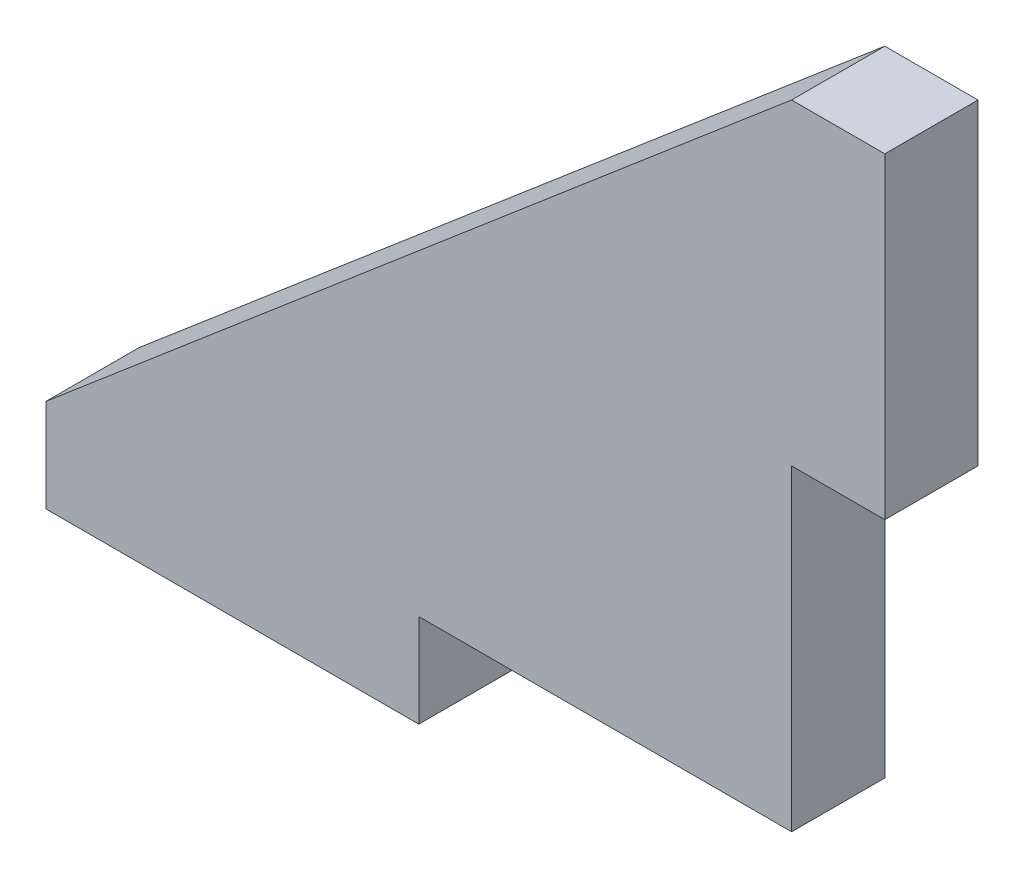
ISO-10303-21;
HEADER;
FILE_DESCRIPTION(('STEP AP214'),'2;1');
FILE_NAME('part.step','',(''),(''),'','','');
FILE_SCHEMA(('AUTOMOTIVE_DESIGN { 1 0 10303 214 1 1 1 1 }'));
ENDSEC;
DATA;
#1=APPLICATION_CONTEXT('core data for automotive mechanical design processes');
#2=APPLICATION_PROTOCOL_DEFINITION('international standard','automotive_design',2000,#1);
#3=PRODUCT_CONTEXT('',#1,'mechanical');
#4=PRODUCT('Part','Part','',(#3));
#5=PRODUCT_RELATED_PRODUCT_CATEGORY('part','',(#4));
#6=PRODUCT_DEFINITION_FORMATION('','',#4);
#7=PRODUCT_DEFINITION_CONTEXT('part definition',#1,'design');
#8=PRODUCT_DEFINITION('design','',#6,#7);
#9=PRODUCT_DEFINITION_SHAPE('','',#8);
#10=(LENGTH_UNIT() NAMED_UNIT(*) SI_UNIT(.MILLI.,.METRE.));
#11=(NAMED_UNIT(*) PLANE_ANGLE_UNIT() SI_UNIT($,.RADIAN.));
#12=(NAMED_UNIT(*) SI_UNIT($,.STERADIAN.) SOLID_ANGLE_UNIT());
#13=UNCERTAINTY_MEASURE_WITH_UNIT(LENGTH_MEASURE(1.E-05),#10,'distance_accuracy_value','');
#14=(GEOMETRIC_REPRESENTATION_CONTEXT(3) GLOBAL_UNCERTAINTY_ASSIGNED_CONTEXT((#13)) GLOBAL_UNIT_ASSIGNED_CONTEXT((#10,
#11,#12)) REPRESENTATION_CONTEXT('',''));
#15=CARTESIAN_POINT('',(0.,0.,0.));
#16=DIRECTION('',(0.,0.,1.));
#17=DIRECTION('',(1.,0.,0.));
#18=AXIS2_PLACEMENT_3D('',#15,#16,#17);
#19=CARTESIAN_POINT('',(45.,0.,5.));
#20=DIRECTION('',(1.,0.,0.));
#21=DIRECTION('',(0.,0.,-1.));
#22=AXIS2_PLACEMENT_3D('',#19,#20,#21);
#23=PLANE('',#22);
#24=DIRECTION('',(0.,-1.,0.));
#25=VECTOR('',#24,1.);
#26=CARTESIAN_POINT('',(45.,0.,0.));
#27=LINE('',#26,#25);
#28=CARTESIAN_POINT('',(45.,34.,0.));
#29=VERTEX_POINT('',#28);
#30=CARTESIAN_POINT('',(45.,17.,0.));
#31=VERTEX_POINT('',#30);
#32=EDGE_CURVE('E132',#29,#31,#27,.T.);
#33=ORIENTED_EDGE('',*,*,#32,.F.);
#34=DIRECTION('',(0.,0.,-1.));
#35=VECTOR('',#34,1.);
#36=CARTESIAN_POINT('',(45.,34.,5.));
#37=LINE('',#36,#35);
#38=CARTESIAN_POINT('',(45.,34.,5.));
#39=VERTEX_POINT('',#38);
#40=EDGE_CURVE('E11',#39,#29,#37,.T.);
#41=ORIENTED_EDGE('',*,*,#40,.F.);
#42=DIRECTION('',(0.,-1.,0.));
#43=VECTOR('',#42,1.);
#44=CARTESIAN_POINT('',(45.,0.,5.));
#45=LINE('',#44,#43);
#46=CARTESIAN_POINT('',(45.,17.,5.));
#47=VERTEX_POINT('',#46);
#48=EDGE_CURVE('E154',#39,#47,#45,.T.);
#49=ORIENTED_EDGE('',*,*,#48,.T.);
#50=DIRECTION('',(0.,0.,-1.));
#51=VECTOR('',#50,1.);
#52=CARTESIAN_POINT('',(45.,17.,5.));
#53=LINE('',#52,#51);
#54=EDGE_CURVE('E87',#47,#31,#53,.T.);
#55=ORIENTED_EDGE('',*,*,#54,.T.);
#56=EDGE_LOOP('',(#33,#41,#49,#55));
#57=FACE_BOUND('',#56,.T.);
#58=ADVANCED_FACE('F34',(#57),#23,.T.);
#59=CARTESIAN_POINT('',(0.,34.,5.));
#60=DIRECTION('',(0.,1.,0.));
#61=DIRECTION('',(-1.,0.,0.));
#62=AXIS2_PLACEMENT_3D('',#59,#60,#61);
#63=PLANE('',#62);
#64=DIRECTION('',(1.,0.,0.));
#65=VECTOR('',#64,1.);
#66=CARTESIAN_POINT('',(0.,34.,0.));
#67=LINE('',#66,#65);
#68=CARTESIAN_POINT('',(40.,34.,0.));
#69=VERTEX_POINT('',#68);
#70=EDGE_CURVE('E135',#69,#29,#67,.T.);
#71=ORIENTED_EDGE('',*,*,#70,.F.);
#72=DIRECTION('',(0.,0.,-1.));
#73=VECTOR('',#72,1.);
#74=CARTESIAN_POINT('',(40.,34.,5.));
#75=LINE('',#74,#73);
#76=CARTESIAN_POINT('',(40.,34.,5.));
#77=VERTEX_POINT('',#76);
#78=EDGE_CURVE('E42',#77,#69,#75,.T.);
#79=ORIENTED_EDGE('',*,*,#78,.F.);
#80=DIRECTION('',(1.,0.,0.));
#81=VECTOR('',#80,1.);
#82=CARTESIAN_POINT('',(0.,34.,5.));
#83=LINE('',#82,#81);
#84=EDGE_CURVE('E193',#77,#39,#83,.T.);
#85=ORIENTED_EDGE('',*,*,#84,.T.);
#86=ORIENTED_EDGE('',*,*,#40,.T.);
#87=EDGE_LOOP('',(#71,#79,#85,#86));
#88=FACE_BOUND('',#87,.T.);
#89=ADVANCED_FACE('F174',(#88),#63,.T.);
#90=CARTESIAN_POINT('',(0.,0.,5.));
#91=DIRECTION('',(-0.647648420095541,0.761939317759459,0.));
#92=DIRECTION('',(-0.761939317759459,-0.647648420095541,0.));
#93=AXIS2_PLACEMENT_3D('',#90,#91,#92);
#94=PLANE('',#93);
#95=DIRECTION('',(0.761939317759459,0.647648420095541,0.));
#96=VECTOR('',#95,1.);
#97=CARTESIAN_POINT('',(0.,0.,0.));
#98=LINE('',#97,#96);
#99=CARTESIAN_POINT('',(0.,0.,0.));
#100=VERTEX_POINT('',#99);
#101=EDGE_CURVE('E138',#100,#69,#98,.T.);
#102=ORIENTED_EDGE('',*,*,#101,.F.);
#103=DIRECTION('',(0.,0.,-1.));
#104=VECTOR('',#103,1.);
#105=CARTESIAN_POINT('',(0.,0.,5.));
#106=LINE('',#105,#104);
#107=CARTESIAN_POINT('',(0.,0.,5.));
#108=VERTEX_POINT('',#107);
#109=EDGE_CURVE('E163',#108,#100,#106,.T.);
#110=ORIENTED_EDGE('',*,*,#109,.F.);
#111=DIRECTION('',(0.761939317759459,0.647648420095541,0.));
#112=VECTOR('',#111,1.);
#113=CARTESIAN_POINT('',(0.,0.,5.));
#114=LINE('',#113,#112);
#115=EDGE_CURVE('E170',#108,#77,#114,.T.);
#116=ORIENTED_EDGE('',*,*,#115,.T.);
#117=ORIENTED_EDGE('',*,*,#78,.T.);
#118=EDGE_LOOP('',(#102,#110,#116,#117));
#119=FACE_BOUND('',#118,.T.);
#120=ADVANCED_FACE('F168',(#119),#94,.T.);
#121=CARTESIAN_POINT('',(0.,0.,5.));
#122=DIRECTION('',(1.,0.,0.));
#123=DIRECTION('',(0.,1.,0.));
#124=AXIS2_PLACEMENT_3D('',#121,#122,#123);
#125=PLANE('',#124);
#126=DIRECTION('',(0.,-1.,0.));
#127=VECTOR('',#126,1.);
#128=CARTESIAN_POINT('',(0.,0.,0.));
#129=LINE('',#128,#127);
#130=CARTESIAN_POINT('',(0.,-5.00000000000001,0.));
#131=VERTEX_POINT('',#130);
#132=EDGE_CURVE('E141',#100,#131,#129,.T.);
#133=ORIENTED_EDGE('',*,*,#132,.T.);
#134=DIRECTION('',(0.,0.,-1.));
#135=VECTOR('',#134,1.);
#136=CARTESIAN_POINT('',(0.,-5.00000000000001,5.));
#137=LINE('',#136,#135);
#138=CARTESIAN_POINT('',(0.,-5.00000000000001,5.));
#139=VERTEX_POINT('',#138);
#140=EDGE_CURVE('E160',#139,#131,#137,.T.);
#141=ORIENTED_EDGE('',*,*,#140,.F.);
#142=DIRECTION('',(0.,-1.,0.));
#143=VECTOR('',#142,1.);
#144=CARTESIAN_POINT('',(0.,0.,5.));
#145=LINE('',#144,#143);
#146=EDGE_CURVE('E188',#108,#139,#145,.T.);
#147=ORIENTED_EDGE('',*,*,#146,.F.);
#148=ORIENTED_EDGE('',*,*,#109,.T.);
#149=EDGE_LOOP('',(#133,#141,#147,#148));
#150=FACE_BOUND('',#149,.T.);
#151=ADVANCED_FACE('F181',(#150),#125,.F.);
#152=CARTESIAN_POINT('',(0.,-5.00000000000001,5.));
#153=DIRECTION('',(0.,1.,0.));
#154=DIRECTION('',(0.,0.,1.));
#155=AXIS2_PLACEMENT_3D('',#152,#153,#154);
#156=PLANE('',#155);
#157=DIRECTION('',(1.,0.,0.));
#158=VECTOR('',#157,1.);
#159=CARTESIAN_POINT('',(0.,-5.00000000000001,0.));
#160=LINE('',#159,#158);
#161=CARTESIAN_POINT('',(20.,-5.00000000000001,0.));
#162=VERTEX_POINT('',#161);
#163=EDGE_CURVE('E143',#131,#162,#160,.T.);
#164=ORIENTED_EDGE('',*,*,#163,.T.);
#165=DIRECTION('',(0.,0.,-1.));
#166=VECTOR('',#165,1.);
#167=CARTESIAN_POINT('',(20.,-5.00000000000001,5.));
#168=LINE('',#167,#166);
#169=CARTESIAN_POINT('',(20.,-5.00000000000001,5.));
#170=VERTEX_POINT('',#169);
#171=EDGE_CURVE('E158',#170,#162,#168,.T.);
#172=ORIENTED_EDGE('',*,*,#171,.F.);
#173=DIRECTION('',(1.,0.,0.));
#174=VECTOR('',#173,1.);
#175=CARTESIAN_POINT('',(0.,-5.00000000000001,5.));
#176=LINE('',#175,#174);
#177=EDGE_CURVE('E187',#139,#170,#176,.T.);
#178=ORIENTED_EDGE('',*,*,#177,.F.);
#179=ORIENTED_EDGE('',*,*,#140,.T.);
#180=EDGE_LOOP('',(#164,#172,#178,#179));
#181=FACE_BOUND('',#180,.T.);
#182=ADVANCED_FACE('F185',(#181),#156,.F.);
#183=CARTESIAN_POINT('',(20.,0.,5.));
#184=DIRECTION('',(1.,0.,0.));
#185=DIRECTION('',(0.,0.,-1.));
#186=AXIS2_PLACEMENT_3D('',#183,#184,#185);
#187=PLANE('',#186);
#188=DIRECTION('',(0.,-1.,0.));
#189=VECTOR('',#188,1.);
#190=CARTESIAN_POINT('',(20.,0.,0.));
#191=LINE('',#190,#189);
#192=CARTESIAN_POINT('',(20.,0.,0.));
#193=VERTEX_POINT('',#192);
#194=EDGE_CURVE('E146',#193,#162,#191,.T.);
#195=ORIENTED_EDGE('',*,*,#194,.F.);
#196=DIRECTION('',(0.,0.,-1.));
#197=VECTOR('',#196,1.);
#198=CARTESIAN_POINT('',(20.,0.,5.));
#199=LINE('',#198,#197);
#200=CARTESIAN_POINT('',(20.,0.,5.));
#201=VERTEX_POINT('',#200);
#202=EDGE_CURVE('E119',#201,#193,#199,.T.);
#203=ORIENTED_EDGE('',*,*,#202,.F.);
#204=DIRECTION('',(0.,-1.,0.));
#205=VECTOR('',#204,1.);
#206=CARTESIAN_POINT('',(20.,0.,5.));
#207=LINE('',#206,#205);
#208=EDGE_CURVE('E125',#201,#170,#207,.T.);
#209=ORIENTED_EDGE('',*,*,#208,.T.);
#210=ORIENTED_EDGE('',*,*,#171,.T.);
#211=EDGE_LOOP('',(#195,#203,#209,#210));
#212=FACE_BOUND('',#211,.T.);
#213=ADVANCED_FACE('F208',(#212),#187,.T.);
#214=CARTESIAN_POINT('',(0.,0.,5.));
#215=DIRECTION('',(0.,-1.,0.));
#216=DIRECTION('',(1.,0.,0.));
#217=AXIS2_PLACEMENT_3D('',#214,#215,#216);
#218=PLANE('',#217);
#219=DIRECTION('',(-1.,0.,0.));
#220=VECTOR('',#219,1.);
#221=CARTESIAN_POINT('',(0.,0.,0.));
#222=LINE('',#221,#220);
#223=CARTESIAN_POINT('',(40.,0.,0.));
#224=VERTEX_POINT('',#223);
#225=EDGE_CURVE('E114',#224,#193,#222,.T.);
#226=ORIENTED_EDGE('',*,*,#225,.F.);
#227=DIRECTION('',(0.,0.,-1.));
#228=VECTOR('',#227,1.);
#229=CARTESIAN_POINT('',(40.,0.,5.));
#230=LINE('',#229,#228);
#231=CARTESIAN_POINT('',(40.,0.,5.));
#232=VERTEX_POINT('',#231);
#233=EDGE_CURVE('E109',#232,#224,#230,.T.);
#234=ORIENTED_EDGE('',*,*,#233,.F.);
#235=DIRECTION('',(-1.,0.,0.));
#236=VECTOR('',#235,1.);
#237=CARTESIAN_POINT('',(0.,0.,5.));
#238=LINE('',#237,#236);
#239=EDGE_CURVE('E112',#232,#201,#238,.T.);
#240=ORIENTED_EDGE('',*,*,#239,.T.);
#241=ORIENTED_EDGE('',*,*,#202,.T.);
#242=EDGE_LOOP('',(#226,#234,#240,#241));
#243=FACE_BOUND('',#242,.T.);
#244=ADVANCED_FACE('F111',(#243),#218,.T.);
#245=CARTESIAN_POINT('',(40.,0.,5.));
#246=DIRECTION('',(1.,0.,0.));
#247=DIRECTION('',(0.,1.,0.));
#248=AXIS2_PLACEMENT_3D('',#245,#246,#247);
#249=PLANE('',#248);
#250=DIRECTION('',(0.,-1.,0.));
#251=VECTOR('',#250,1.);
#252=CARTESIAN_POINT('',(40.,0.,0.));
#253=LINE('',#252,#251);
#254=CARTESIAN_POINT('',(40.,17.,0.));
#255=VERTEX_POINT('',#254);
#256=EDGE_CURVE('E150',#255,#224,#253,.T.);
#257=ORIENTED_EDGE('',*,*,#256,.F.);
#258=DIRECTION('',(0.,0.,-1.));
#259=VECTOR('',#258,1.);
#260=CARTESIAN_POINT('',(40.,17.,5.));
#261=LINE('',#260,#259);
#262=CARTESIAN_POINT('',(40.,17.,5.));
#263=VERTEX_POINT('',#262);
#264=EDGE_CURVE('E80',#263,#255,#261,.T.);
#265=ORIENTED_EDGE('',*,*,#264,.F.);
#266=DIRECTION('',(0.,-1.,0.));
#267=VECTOR('',#266,1.);
#268=CARTESIAN_POINT('',(40.,0.,5.));
#269=LINE('',#268,#267);
#270=EDGE_CURVE('E123',#263,#232,#269,.T.);
#271=ORIENTED_EDGE('',*,*,#270,.T.);
#272=ORIENTED_EDGE('',*,*,#233,.T.);
#273=EDGE_LOOP('',(#257,#265,#271,#272));
#274=FACE_BOUND('',#273,.T.);
#275=ADVANCED_FACE('F127',(#274),#249,.T.);
#276=CARTESIAN_POINT('',(0.,17.,5.));
#277=DIRECTION('',(0.,1.,0.));
#278=DIRECTION('',(0.,0.,1.));
#279=AXIS2_PLACEMENT_3D('',#276,#277,#278);
#280=PLANE('',#279);
#281=DIRECTION('',(1.,0.,0.));
#282=VECTOR('',#281,1.);
#283=CARTESIAN_POINT('',(0.,17.,0.));
#284=LINE('',#283,#282);
#285=EDGE_CURVE('E152',#255,#31,#284,.T.);
#286=ORIENTED_EDGE('',*,*,#285,.T.);
#287=ORIENTED_EDGE('',*,*,#54,.F.);
#288=DIRECTION('',(1.,0.,0.));
#289=VECTOR('',#288,1.);
#290=CARTESIAN_POINT('',(0.,17.,5.));
#291=LINE('',#290,#289);
#292=EDGE_CURVE('E50',#263,#47,#291,.T.);
#293=ORIENTED_EDGE('',*,*,#292,.F.);
#294=ORIENTED_EDGE('',*,*,#264,.T.);
#295=EDGE_LOOP('',(#286,#287,#293,#294));
#296=FACE_BOUND('',#295,.T.);
#297=ADVANCED_FACE('F216',(#296),#280,.F.);
#298=CARTESIAN_POINT('',(0.,0.,5.));
#299=DIRECTION('',(0.,0.,1.));
#300=DIRECTION('',(1.,0.,0.));
#301=AXIS2_PLACEMENT_3D('',#298,#299,#300);
#302=PLANE('',#301);
#303=ORIENTED_EDGE('',*,*,#48,.F.);
#304=ORIENTED_EDGE('',*,*,#84,.F.);
#305=ORIENTED_EDGE('',*,*,#115,.F.);
#306=ORIENTED_EDGE('',*,*,#146,.T.);
#307=ORIENTED_EDGE('',*,*,#177,.T.);
#308=ORIENTED_EDGE('',*,*,#208,.F.);
#309=ORIENTED_EDGE('',*,*,#239,.F.);
#310=ORIENTED_EDGE('',*,*,#270,.F.);
#311=ORIENTED_EDGE('',*,*,#292,.T.);
#312=EDGE_LOOP('',(#303,#304,#305,#306,#307,#308,#309,#310,#311));
#313=FACE_BOUND('',#312,.T.);
#314=ADVANCED_FACE('F122',(#313),#302,.T.);
#315=CARTESIAN_POINT('',(0.,0.,0.));
#316=DIRECTION('',(0.,0.,1.));
#317=DIRECTION('',(1.,0.,0.));
#318=AXIS2_PLACEMENT_3D('',#315,#316,#317);
#319=PLANE('',#318);
#320=ORIENTED_EDGE('',*,*,#32,.T.);
#321=ORIENTED_EDGE('',*,*,#285,.F.);
#322=ORIENTED_EDGE('',*,*,#256,.T.);
#323=ORIENTED_EDGE('',*,*,#225,.T.);
#324=ORIENTED_EDGE('',*,*,#194,.T.);
#325=ORIENTED_EDGE('',*,*,#163,.F.);
#326=ORIENTED_EDGE('',*,*,#132,.F.);
#327=ORIENTED_EDGE('',*,*,#101,.T.);
#328=ORIENTED_EDGE('',*,*,#70,.T.);
#329=EDGE_LOOP('',(#320,#321,#322,#323,#324,#325,#326,#327,#328));
#330=FACE_BOUND('',#329,.T.);
#331=ADVANCED_FACE('F177',(#330),#319,.F.);
#332=CLOSED_SHELL('',(#58,#89,#120,#151,#182,#213,#244,#275,#297,#314,#331));
#333=MANIFOLD_SOLID_BREP('B2',#332);
#334=ADVANCED_BREP_SHAPE_REPRESENTATION('',(#18,#333),#14);
#335=SHAPE_DEFINITION_REPRESENTATION(#9,#334);
ENDSEC;
END-ISO-10303-21;
